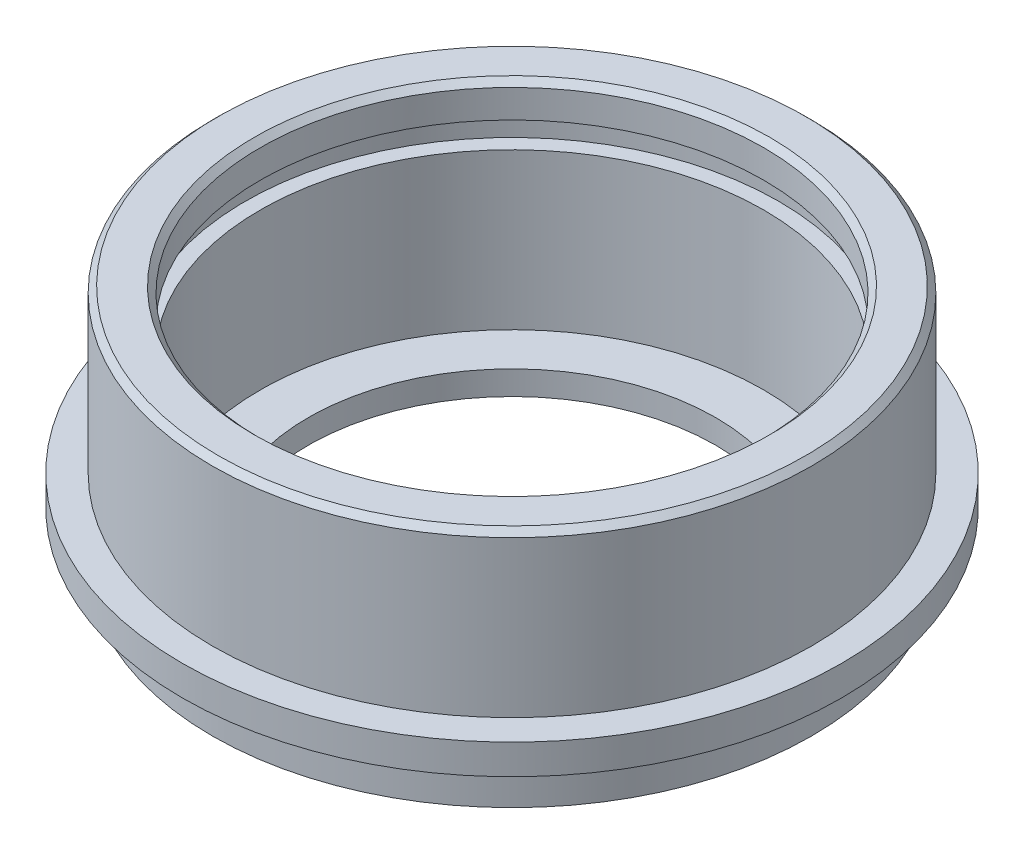
ISO-10303-21;
HEADER;
FILE_DESCRIPTION(('STEP AP214'),'2;1');
FILE_NAME('part.step','',(''),(''),'','','');
FILE_SCHEMA(('AUTOMOTIVE_DESIGN { 1 0 10303 214 1 1 1 1 }'));
ENDSEC;
DATA;
#1=APPLICATION_CONTEXT('core data for automotive mechanical design processes');
#2=APPLICATION_PROTOCOL_DEFINITION('international standard','automotive_design',2000,#1);
#3=PRODUCT_CONTEXT('',#1,'mechanical');
#4=PRODUCT('Part','Part','',(#3));
#5=PRODUCT_RELATED_PRODUCT_CATEGORY('part','',(#4));
#6=PRODUCT_DEFINITION_FORMATION('','',#4);
#7=PRODUCT_DEFINITION_CONTEXT('part definition',#1,'design');
#8=PRODUCT_DEFINITION('design','',#6,#7);
#9=PRODUCT_DEFINITION_SHAPE('','',#8);
#10=(LENGTH_UNIT() NAMED_UNIT(*) SI_UNIT(.MILLI.,.METRE.));
#11=(NAMED_UNIT(*) PLANE_ANGLE_UNIT() SI_UNIT($,.RADIAN.));
#12=(NAMED_UNIT(*) SI_UNIT($,.STERADIAN.) SOLID_ANGLE_UNIT());
#13=UNCERTAINTY_MEASURE_WITH_UNIT(LENGTH_MEASURE(1.E-05),#10,'distance_accuracy_value','');
#14=(GEOMETRIC_REPRESENTATION_CONTEXT(3) GLOBAL_UNCERTAINTY_ASSIGNED_CONTEXT((#13)) GLOBAL_UNIT_ASSIGNED_CONTEXT((#10,
#11,#12)) REPRESENTATION_CONTEXT('',''));
#15=CARTESIAN_POINT('',(0.,0.,0.));
#16=DIRECTION('',(0.,0.,1.));
#17=DIRECTION('',(1.,0.,0.));
#18=AXIS2_PLACEMENT_3D('',#15,#16,#17);
#19=CARTESIAN_POINT('',(25.,0.,0.));
#20=DIRECTION('',(0.,-1.,0.));
#21=DIRECTION('',(0.,0.,-1.));
#22=AXIS2_PLACEMENT_3D('',#19,#20,#21);
#23=PLANE('',#22);
#24=CARTESIAN_POINT('',(0.,0.,0.));
#25=DIRECTION('',(0.,-1.,0.));
#26=DIRECTION('',(0.,0.,-1.));
#27=AXIS2_PLACEMENT_3D('',#24,#25,#26);
#28=CIRCLE('',#27,25.);
#29=CARTESIAN_POINT('',(0.,0.,-25.));
#30=VERTEX_POINT('',#29);
#31=EDGE_CURVE('E83',#30,#30,#28,.T.);
#32=ORIENTED_EDGE('',*,*,#31,.T.);
#33=EDGE_LOOP('',(#32));
#34=FACE_BOUND('',#33,.T.);
#35=CARTESIAN_POINT('',(0.,0.,0.));
#36=DIRECTION('',(0.,-1.,0.));
#37=DIRECTION('',(0.,0.,-1.));
#38=AXIS2_PLACEMENT_3D('',#35,#36,#37);
#39=CIRCLE('',#38,17.);
#40=CARTESIAN_POINT('',(0.,0.,-17.));
#41=VERTEX_POINT('',#40);
#42=EDGE_CURVE('E50',#41,#41,#39,.T.);
#43=ORIENTED_EDGE('',*,*,#42,.F.);
#44=EDGE_LOOP('',(#43));
#45=FACE_BOUND('',#44,.T.);
#46=ADVANCED_FACE('F30',(#34,#45),#23,.T.);
#47=CARTESIAN_POINT('',(0.,0.,0.));
#48=DIRECTION('',(0.,-1.,0.));
#49=DIRECTION('',(0.,0.,-1.));
#50=AXIS2_PLACEMENT_3D('',#47,#48,#49);
#51=CYLINDRICAL_SURFACE('',#50,17.);
#52=ORIENTED_EDGE('',*,*,#42,.T.);
#53=EDGE_LOOP('',(#52));
#54=FACE_BOUND('',#53,.T.);
#55=CARTESIAN_POINT('',(0.,1.99999999999999,0.));
#56=DIRECTION('',(0.,-1.,0.));
#57=DIRECTION('',(0.,0.,-1.));
#58=AXIS2_PLACEMENT_3D('',#55,#56,#57);
#59=CIRCLE('',#58,17.);
#60=CARTESIAN_POINT('',(0.,1.99999999999999,-17.));
#61=VERTEX_POINT('',#60);
#62=EDGE_CURVE('E53',#61,#61,#59,.T.);
#63=ORIENTED_EDGE('',*,*,#62,.F.);
#64=EDGE_LOOP('',(#63));
#65=FACE_BOUND('',#64,.T.);
#66=ADVANCED_FACE('F104',(#54,#65),#51,.F.);
#67=CARTESIAN_POINT('',(17.,1.99999999999999,0.));
#68=DIRECTION('',(0.,1.,0.));
#69=DIRECTION('',(0.,0.,1.));
#70=AXIS2_PLACEMENT_3D('',#67,#68,#69);
#71=PLANE('',#70);
#72=ORIENTED_EDGE('',*,*,#62,.T.);
#73=EDGE_LOOP('',(#72));
#74=FACE_BOUND('',#73,.T.);
#75=CARTESIAN_POINT('',(0.,1.99999999999999,0.));
#76=DIRECTION('',(0.,-1.,0.));
#77=DIRECTION('',(0.,0.,-1.));
#78=AXIS2_PLACEMENT_3D('',#75,#76,#77);
#79=CIRCLE('',#78,21.);
#80=CARTESIAN_POINT('',(0.,1.99999999999999,-21.));
#81=VERTEX_POINT('',#80);
#82=EDGE_CURVE('E56',#81,#81,#79,.T.);
#83=ORIENTED_EDGE('',*,*,#82,.F.);
#84=EDGE_LOOP('',(#83));
#85=FACE_BOUND('',#84,.T.);
#86=ADVANCED_FACE('F109',(#74,#85),#71,.T.);
#87=CARTESIAN_POINT('',(0.,0.,0.));
#88=DIRECTION('',(0.,-1.,0.));
#89=DIRECTION('',(0.,0.,-1.));
#90=AXIS2_PLACEMENT_3D('',#87,#88,#89);
#91=CYLINDRICAL_SURFACE('',#90,21.);
#92=ORIENTED_EDGE('',*,*,#82,.T.);
#93=EDGE_LOOP('',(#92));
#94=FACE_BOUND('',#93,.T.);
#95=CARTESIAN_POINT('',(0.,15.,0.));
#96=DIRECTION('',(0.,-1.,0.));
#97=DIRECTION('',(0.,0.,-1.));
#98=AXIS2_PLACEMENT_3D('',#95,#96,#97);
#99=CIRCLE('',#98,21.);
#100=CARTESIAN_POINT('',(0.,15.,-21.));
#101=VERTEX_POINT('',#100);
#102=EDGE_CURVE('E59',#101,#101,#99,.T.);
#103=ORIENTED_EDGE('',*,*,#102,.F.);
#104=EDGE_LOOP('',(#103));
#105=FACE_BOUND('',#104,.T.);
#106=ADVANCED_FACE('F115',(#94,#105),#91,.F.);
#107=CARTESIAN_POINT('',(21.,15.,0.));
#108=DIRECTION('',(0.,1.,0.));
#109=DIRECTION('',(0.,0.,1.));
#110=AXIS2_PLACEMENT_3D('',#107,#108,#109);
#111=PLANE('',#110);
#112=ORIENTED_EDGE('',*,*,#102,.T.);
#113=EDGE_LOOP('',(#112));
#114=FACE_BOUND('',#113,.T.);
#115=CARTESIAN_POINT('',(0.,15.,0.));
#116=DIRECTION('',(0.,-1.,0.));
#117=DIRECTION('',(0.,0.,-1.));
#118=AXIS2_PLACEMENT_3D('',#115,#116,#117);
#119=CIRCLE('',#118,22.25);
#120=CARTESIAN_POINT('',(0.,15.,-22.25));
#121=VERTEX_POINT('',#120);
#122=EDGE_CURVE('E62',#121,#121,#119,.T.);
#123=ORIENTED_EDGE('',*,*,#122,.F.);
#124=EDGE_LOOP('',(#123));
#125=FACE_BOUND('',#124,.T.);
#126=ADVANCED_FACE('F119',(#114,#125),#111,.T.);
#127=CARTESIAN_POINT('',(0.,0.,0.));
#128=DIRECTION('',(0.,-1.,0.));
#129=DIRECTION('',(0.,0.,-1.));
#130=AXIS2_PLACEMENT_3D('',#127,#128,#129);
#131=CYLINDRICAL_SURFACE('',#130,22.25);
#132=ORIENTED_EDGE('',*,*,#122,.T.);
#133=EDGE_LOOP('',(#132));
#134=FACE_BOUND('',#133,.T.);
#135=CARTESIAN_POINT('',(0.,17.15,0.));
#136=DIRECTION('',(0.,-1.,0.));
#137=DIRECTION('',(0.,0.,-1.));
#138=AXIS2_PLACEMENT_3D('',#135,#136,#137);
#139=CIRCLE('',#138,22.25);
#140=CARTESIAN_POINT('',(0.,17.15,-22.25));
#141=VERTEX_POINT('',#140);
#142=EDGE_CURVE('E65',#141,#141,#139,.T.);
#143=ORIENTED_EDGE('',*,*,#142,.F.);
#144=EDGE_LOOP('',(#143));
#145=FACE_BOUND('',#144,.T.);
#146=ADVANCED_FACE('F123',(#134,#145),#131,.F.);
#147=CARTESIAN_POINT('',(22.25,17.15,0.));
#148=DIRECTION('',(0.,-1.,0.));
#149=DIRECTION('',(0.,0.,-1.));
#150=AXIS2_PLACEMENT_3D('',#147,#148,#149);
#151=PLANE('',#150);
#152=ORIENTED_EDGE('',*,*,#142,.T.);
#153=EDGE_LOOP('',(#152));
#154=FACE_BOUND('',#153,.T.);
#155=CARTESIAN_POINT('',(0.,17.15,0.));
#156=DIRECTION('',(0.,-1.,0.));
#157=DIRECTION('',(0.,0.,-1.));
#158=AXIS2_PLACEMENT_3D('',#155,#156,#157);
#159=CIRCLE('',#158,21.);
#160=CARTESIAN_POINT('',(0.,17.15,-21.));
#161=VERTEX_POINT('',#160);
#162=EDGE_CURVE('E68',#161,#161,#159,.T.);
#163=ORIENTED_EDGE('',*,*,#162,.F.);
#164=EDGE_LOOP('',(#163));
#165=FACE_BOUND('',#164,.T.);
#166=ADVANCED_FACE('F127',(#154,#165),#151,.T.);
#167=CARTESIAN_POINT('',(0.,0.,0.));
#168=DIRECTION('',(0.,-1.,0.));
#169=DIRECTION('',(0.,0.,-1.));
#170=AXIS2_PLACEMENT_3D('',#167,#168,#169);
#171=CYLINDRICAL_SURFACE('',#170,21.);
#172=CARTESIAN_POINT('',(0.,19.5,0.));
#173=DIRECTION('',(0.,1.,0.));
#174=DIRECTION('',(0.,0.,1.));
#175=AXIS2_PLACEMENT_3D('',#172,#173,#174);
#176=CIRCLE('',#175,21.);
#177=CARTESIAN_POINT('',(0.,19.5,21.));
#178=VERTEX_POINT('',#177);
#179=EDGE_CURVE('E10',#178,#178,#176,.T.);
#180=ORIENTED_EDGE('',*,*,#179,.T.);
#181=EDGE_LOOP('',(#180));
#182=FACE_BOUND('',#181,.T.);
#183=ORIENTED_EDGE('',*,*,#162,.T.);
#184=EDGE_LOOP('',(#183));
#185=FACE_BOUND('',#184,.T.);
#186=ADVANCED_FACE('F131',(#182,#185),#171,.F.);
#187=CARTESIAN_POINT('',(21.,20.,0.));
#188=DIRECTION('',(0.,1.,0.));
#189=DIRECTION('',(0.,0.,1.));
#190=AXIS2_PLACEMENT_3D('',#187,#188,#189);
#191=PLANE('',#190);
#192=CARTESIAN_POINT('',(0.,20.,0.));
#193=DIRECTION('',(0.,1.,0.));
#194=DIRECTION('',(0.,0.,1.));
#195=AXIS2_PLACEMENT_3D('',#192,#193,#194);
#196=CIRCLE('',#195,24.5);
#197=CARTESIAN_POINT('',(0.,20.,24.5));
#198=VERTEX_POINT('',#197);
#199=EDGE_CURVE('E37',#198,#198,#196,.T.);
#200=ORIENTED_EDGE('',*,*,#199,.T.);
#201=EDGE_LOOP('',(#200));
#202=FACE_BOUND('',#201,.T.);
#203=CARTESIAN_POINT('',(0.,20.,0.));
#204=DIRECTION('',(0.,1.,0.));
#205=DIRECTION('',(0.,0.,1.));
#206=AXIS2_PLACEMENT_3D('',#203,#204,#205);
#207=CIRCLE('',#206,21.5);
#208=CARTESIAN_POINT('',(0.,20.,21.5));
#209=VERTEX_POINT('',#208);
#210=EDGE_CURVE('E41',#209,#209,#207,.F.);
#211=ORIENTED_EDGE('',*,*,#210,.T.);
#212=EDGE_LOOP('',(#211));
#213=FACE_BOUND('',#212,.T.);
#214=ADVANCED_FACE('F135',(#202,#213),#191,.T.);
#215=CARTESIAN_POINT('',(0.,0.,0.));
#216=DIRECTION('',(0.,-1.,0.));
#217=DIRECTION('',(0.,0.,-1.));
#218=AXIS2_PLACEMENT_3D('',#215,#216,#217);
#219=CYLINDRICAL_SURFACE('',#218,25.);
#220=CARTESIAN_POINT('',(0.,19.5,0.));
#221=DIRECTION('',(0.,1.,0.));
#222=DIRECTION('',(0.,0.,1.));
#223=AXIS2_PLACEMENT_3D('',#220,#221,#222);
#224=CIRCLE('',#223,25.);
#225=CARTESIAN_POINT('',(0.,19.5,25.));
#226=VERTEX_POINT('',#225);
#227=EDGE_CURVE('E45',#226,#226,#224,.F.);
#228=ORIENTED_EDGE('',*,*,#227,.T.);
#229=EDGE_LOOP('',(#228));
#230=FACE_BOUND('',#229,.T.);
#231=CARTESIAN_POINT('',(0.,6.50000000000001,0.));
#232=DIRECTION('',(0.,-1.,0.));
#233=DIRECTION('',(0.,0.,-1.));
#234=AXIS2_PLACEMENT_3D('',#231,#232,#233);
#235=CIRCLE('',#234,25.);
#236=CARTESIAN_POINT('',(0.,6.50000000000001,-25.));
#237=VERTEX_POINT('',#236);
#238=EDGE_CURVE('E71',#237,#237,#235,.T.);
#239=ORIENTED_EDGE('',*,*,#238,.F.);
#240=EDGE_LOOP('',(#239));
#241=FACE_BOUND('',#240,.T.);
#242=ADVANCED_FACE('F138',(#230,#241),#219,.T.);
#243=CARTESIAN_POINT('',(25.,6.50000000000001,0.));
#244=DIRECTION('',(0.,1.,0.));
#245=DIRECTION('',(0.,0.,1.));
#246=AXIS2_PLACEMENT_3D('',#243,#244,#245);
#247=PLANE('',#246);
#248=ORIENTED_EDGE('',*,*,#238,.T.);
#249=EDGE_LOOP('',(#248));
#250=FACE_BOUND('',#249,.T.);
#251=CARTESIAN_POINT('',(0.,6.50000000000001,0.));
#252=DIRECTION('',(0.,-1.,0.));
#253=DIRECTION('',(0.,0.,-1.));
#254=AXIS2_PLACEMENT_3D('',#251,#252,#253);
#255=CIRCLE('',#254,27.5);
#256=CARTESIAN_POINT('',(0.,6.50000000000001,-27.5));
#257=VERTEX_POINT('',#256);
#258=EDGE_CURVE('E74',#257,#257,#255,.T.);
#259=ORIENTED_EDGE('',*,*,#258,.F.);
#260=EDGE_LOOP('',(#259));
#261=FACE_BOUND('',#260,.T.);
#262=ADVANCED_FACE('F141',(#250,#261),#247,.T.);
#263=CARTESIAN_POINT('',(0.,0.,0.));
#264=DIRECTION('',(0.,-1.,0.));
#265=DIRECTION('',(0.,0.,-1.));
#266=AXIS2_PLACEMENT_3D('',#263,#264,#265);
#267=CYLINDRICAL_SURFACE('',#266,27.5);
#268=ORIENTED_EDGE('',*,*,#258,.T.);
#269=EDGE_LOOP('',(#268));
#270=FACE_BOUND('',#269,.T.);
#271=CARTESIAN_POINT('',(0.,4.00000000000001,0.));
#272=DIRECTION('',(0.,-1.,0.));
#273=DIRECTION('',(0.,0.,-1.));
#274=AXIS2_PLACEMENT_3D('',#271,#272,#273);
#275=CIRCLE('',#274,27.5);
#276=CARTESIAN_POINT('',(0.,4.00000000000001,-27.5));
#277=VERTEX_POINT('',#276);
#278=EDGE_CURVE('E77',#277,#277,#275,.T.);
#279=ORIENTED_EDGE('',*,*,#278,.F.);
#280=EDGE_LOOP('',(#279));
#281=FACE_BOUND('',#280,.T.);
#282=ADVANCED_FACE('F100',(#270,#281),#267,.T.);
#283=CARTESIAN_POINT('',(27.5,4.00000000000001,0.));
#284=DIRECTION('',(0.,-1.,0.));
#285=DIRECTION('',(0.,0.,-1.));
#286=AXIS2_PLACEMENT_3D('',#283,#284,#285);
#287=PLANE('',#286);
#288=ORIENTED_EDGE('',*,*,#278,.T.);
#289=EDGE_LOOP('',(#288));
#290=FACE_BOUND('',#289,.T.);
#291=CARTESIAN_POINT('',(0.,4.00000000000001,0.));
#292=DIRECTION('',(0.,-1.,0.));
#293=DIRECTION('',(0.,0.,-1.));
#294=AXIS2_PLACEMENT_3D('',#291,#292,#293);
#295=CIRCLE('',#294,25.);
#296=CARTESIAN_POINT('',(0.,4.00000000000001,-25.));
#297=VERTEX_POINT('',#296);
#298=EDGE_CURVE('E80',#297,#297,#295,.T.);
#299=ORIENTED_EDGE('',*,*,#298,.F.);
#300=EDGE_LOOP('',(#299));
#301=FACE_BOUND('',#300,.T.);
#302=ADVANCED_FACE('F92',(#290,#301),#287,.T.);
#303=CARTESIAN_POINT('',(0.,0.,0.));
#304=DIRECTION('',(0.,-1.,0.));
#305=DIRECTION('',(0.,0.,-1.));
#306=AXIS2_PLACEMENT_3D('',#303,#304,#305);
#307=CYLINDRICAL_SURFACE('',#306,25.);
#308=ORIENTED_EDGE('',*,*,#298,.T.);
#309=EDGE_LOOP('',(#308));
#310=FACE_BOUND('',#309,.T.);
#311=ORIENTED_EDGE('',*,*,#31,.F.);
#312=EDGE_LOOP('',(#311));
#313=FACE_BOUND('',#312,.T.);
#314=ADVANCED_FACE('F89',(#310,#313),#307,.T.);
#315=CARTESIAN_POINT('',(0.,19.5,0.));
#316=DIRECTION('',(0.,-1.,0.));
#317=DIRECTION('',(0.,0.,-1.));
#318=AXIS2_PLACEMENT_3D('',#315,#316,#317);
#319=CONICAL_SURFACE('',#318,25.,0.785398163397448);
#320=ORIENTED_EDGE('',*,*,#199,.F.);
#321=EDGE_LOOP('',(#320));
#322=FACE_BOUND('',#321,.T.);
#323=ORIENTED_EDGE('',*,*,#227,.F.);
#324=EDGE_LOOP('',(#323));
#325=FACE_BOUND('',#324,.T.);
#326=ADVANCED_FACE('F91',(#322,#325),#319,.T.);
#327=CARTESIAN_POINT('',(0.,20.,0.));
#328=DIRECTION('',(0.,1.,0.));
#329=DIRECTION('',(0.,0.,1.));
#330=AXIS2_PLACEMENT_3D('',#327,#328,#329);
#331=CONICAL_SURFACE('',#330,21.5,0.785398163397445);
#332=ORIENTED_EDGE('',*,*,#179,.F.);
#333=EDGE_LOOP('',(#332));
#334=FACE_BOUND('',#333,.T.);
#335=ORIENTED_EDGE('',*,*,#210,.F.);
#336=EDGE_LOOP('',(#335));
#337=FACE_BOUND('',#336,.T.);
#338=ADVANCED_FACE('F32',(#334,#337),#331,.F.);
#339=CLOSED_SHELL('',(#46,#66,#86,#106,#126,#146,#166,#186,#214,#242,#262,#282,#302,#314,#326,#338));
#340=MANIFOLD_SOLID_BREP('B2',#339);
#341=ADVANCED_BREP_SHAPE_REPRESENTATION('',(#18,#340),#14);
#342=SHAPE_DEFINITION_REPRESENTATION(#9,#341);
ENDSEC;
END-ISO-10303-21;
